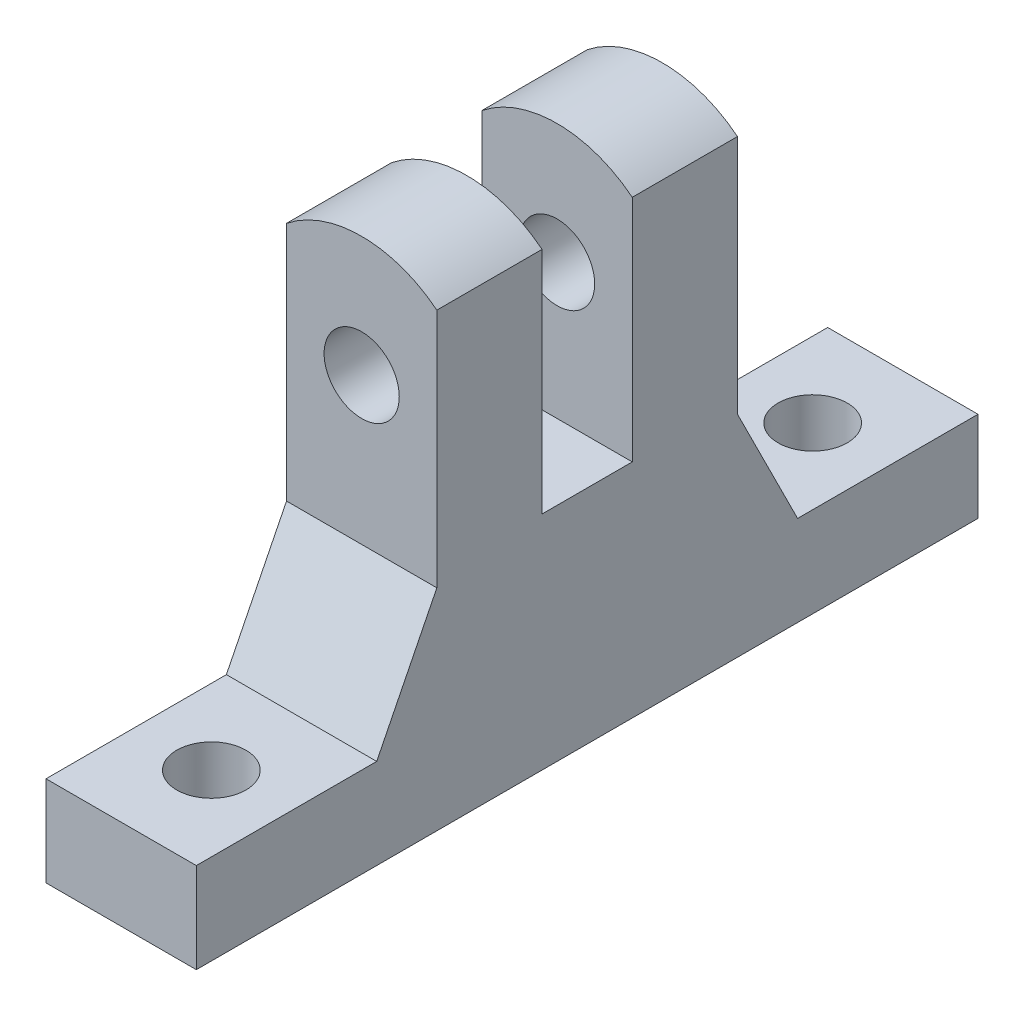
ISO-10303-21;
HEADER;
FILE_DESCRIPTION(('STEP AP214'),'2;1');
FILE_NAME('part.step','',(''),(''),'','','');
FILE_SCHEMA(('AUTOMOTIVE_DESIGN { 1 0 10303 214 1 1 1 1 }'));
ENDSEC;
DATA;
#1=APPLICATION_CONTEXT('core data for automotive mechanical design processes');
#2=APPLICATION_PROTOCOL_DEFINITION('international standard','automotive_design',2000,#1);
#3=PRODUCT_CONTEXT('',#1,'mechanical');
#4=PRODUCT('Part','Part','',(#3));
#5=PRODUCT_RELATED_PRODUCT_CATEGORY('part','',(#4));
#6=PRODUCT_DEFINITION_FORMATION('','',#4);
#7=PRODUCT_DEFINITION_CONTEXT('part definition',#1,'design');
#8=PRODUCT_DEFINITION('design','',#6,#7);
#9=PRODUCT_DEFINITION_SHAPE('','',#8);
#10=(LENGTH_UNIT() NAMED_UNIT(*) SI_UNIT(.MILLI.,.METRE.));
#11=(NAMED_UNIT(*) PLANE_ANGLE_UNIT() SI_UNIT($,.RADIAN.));
#12=(NAMED_UNIT(*) SI_UNIT($,.STERADIAN.) SOLID_ANGLE_UNIT());
#13=UNCERTAINTY_MEASURE_WITH_UNIT(LENGTH_MEASURE(1.E-05),#10,'distance_accuracy_value','');
#14=(GEOMETRIC_REPRESENTATION_CONTEXT(3) GLOBAL_UNCERTAINTY_ASSIGNED_CONTEXT((#13)) GLOBAL_UNIT_ASSIGNED_CONTEXT((#10,
#11,#12)) REPRESENTATION_CONTEXT('',''));
#15=CARTESIAN_POINT('',(0.,0.,0.));
#16=DIRECTION('',(0.,0.,1.));
#17=DIRECTION('',(1.,0.,0.));
#18=AXIS2_PLACEMENT_3D('',#15,#16,#17);
#19=CARTESIAN_POINT('',(0.,11.8775010008008,-10.));
#20=DIRECTION('',(0.,0.,1.));
#21=DIRECTION('',(1.,0.,0.));
#22=AXIS2_PLACEMENT_3D('',#19,#20,#21);
#23=CYLINDRICAL_SURFACE('',#22,4.);
#24=CARTESIAN_POINT('',(0.,11.8775010008008,-6.5));
#25=DIRECTION('',(0.,0.,-1.));
#26=DIRECTION('',(0.,1.,0.));
#27=AXIS2_PLACEMENT_3D('',#24,#25,#26);
#28=CIRCLE('',#27,4.);
#29=CARTESIAN_POINT('',(2.5,15.,-6.5));
#30=VERTEX_POINT('',#29);
#31=CARTESIAN_POINT('',(-2.5,15.,-6.5));
#32=VERTEX_POINT('',#31);
#33=EDGE_CURVE('E202',#30,#32,#28,.F.);
#34=ORIENTED_EDGE('',*,*,#33,.F.);
#35=DIRECTION('',(0.,0.,1.));
#36=VECTOR('',#35,1.);
#37=CARTESIAN_POINT('',(2.5,15.,-10.));
#38=LINE('',#37,#36);
#39=CARTESIAN_POINT('',(2.5,15.,-10.));
#40=VERTEX_POINT('',#39);
#41=EDGE_CURVE('E226',#40,#30,#38,.T.);
#42=ORIENTED_EDGE('',*,*,#41,.F.);
#43=CARTESIAN_POINT('',(0.,11.8775010008008,-10.));
#44=DIRECTION('',(0.,0.,1.));
#45=DIRECTION('',(1.,0.,0.));
#46=AXIS2_PLACEMENT_3D('',#43,#44,#45);
#47=CIRCLE('',#46,4.);
#48=CARTESIAN_POINT('',(-2.5,15.,-10.));
#49=VERTEX_POINT('',#48);
#50=EDGE_CURVE('E211',#40,#49,#47,.T.);
#51=ORIENTED_EDGE('',*,*,#50,.T.);
#52=DIRECTION('',(0.,0.,1.));
#53=VECTOR('',#52,1.);
#54=CARTESIAN_POINT('',(-2.5,15.,-10.));
#55=LINE('',#54,#53);
#56=EDGE_CURVE('E235',#49,#32,#55,.T.);
#57=ORIENTED_EDGE('',*,*,#56,.T.);
#58=EDGE_LOOP('',(#34,#42,#51,#57));
#59=FACE_BOUND('',#58,.T.);
#60=ADVANCED_FACE('F32',(#59),#23,.T.);
#61=CARTESIAN_POINT('',(0.,11.8775010008008,-10.));
#62=DIRECTION('',(0.,0.,1.));
#63=DIRECTION('',(1.,0.,0.));
#64=AXIS2_PLACEMENT_3D('',#61,#62,#63);
#65=CYLINDRICAL_SURFACE('',#64,1.25);
#66=CARTESIAN_POINT('',(0.,11.8775010008008,-6.5));
#67=DIRECTION('',(0.,0.,-1.));
#68=DIRECTION('',(0.,1.,0.));
#69=AXIS2_PLACEMENT_3D('',#66,#67,#68);
#70=CIRCLE('',#69,1.25);
#71=CARTESIAN_POINT('',(0.,13.1275010008008,-6.5));
#72=VERTEX_POINT('',#71);
#73=EDGE_CURVE('E201',#72,#72,#70,.F.);
#74=ORIENTED_EDGE('',*,*,#73,.T.);
#75=EDGE_LOOP('',(#74));
#76=FACE_BOUND('',#75,.T.);
#77=CARTESIAN_POINT('',(0.,11.8775010008008,-10.));
#78=DIRECTION('',(0.,0.,1.));
#79=DIRECTION('',(1.,0.,0.));
#80=AXIS2_PLACEMENT_3D('',#77,#78,#79);
#81=CIRCLE('',#80,1.25);
#82=CARTESIAN_POINT('',(1.25,11.8775010008008,-10.));
#83=VERTEX_POINT('',#82);
#84=EDGE_CURVE('E205',#83,#83,#81,.T.);
#85=ORIENTED_EDGE('',*,*,#84,.F.);
#86=EDGE_LOOP('',(#85));
#87=FACE_BOUND('',#86,.T.);
#88=ADVANCED_FACE('F307',(#76,#87),#65,.F.);
#89=CARTESIAN_POINT('',(0.,11.8775010008008,-3.5));
#90=DIRECTION('',(0.,0.,1.));
#91=DIRECTION('',(0.,-1.,0.));
#92=AXIS2_PLACEMENT_3D('',#89,#90,#91);
#93=CIRCLE('',#92,4.);
#94=CARTESIAN_POINT('',(-2.5,15.,-3.5));
#95=VERTEX_POINT('',#94);
#96=CARTESIAN_POINT('',(2.5,15.,-3.5));
#97=VERTEX_POINT('',#96);
#98=EDGE_CURVE('E199',#95,#97,#93,.F.);
#99=ORIENTED_EDGE('',*,*,#98,.F.);
#100=CARTESIAN_POINT('',(-2.5,15.,0.));
#101=VERTEX_POINT('',#100);
#102=EDGE_CURVE('E220',#95,#101,#55,.T.);
#103=ORIENTED_EDGE('',*,*,#102,.T.);
#104=CARTESIAN_POINT('',(0.,11.8775010008008,0.));
#105=DIRECTION('',(0.,0.,1.));
#106=DIRECTION('',(1.,0.,0.));
#107=AXIS2_PLACEMENT_3D('',#104,#105,#106);
#108=CIRCLE('',#107,4.);
#109=CARTESIAN_POINT('',(2.5,15.,0.));
#110=VERTEX_POINT('',#109);
#111=EDGE_CURVE('E208',#110,#101,#108,.T.);
#112=ORIENTED_EDGE('',*,*,#111,.F.);
#113=EDGE_CURVE('E230',#97,#110,#38,.T.);
#114=ORIENTED_EDGE('',*,*,#113,.F.);
#115=EDGE_LOOP('',(#99,#103,#112,#114));
#116=FACE_BOUND('',#115,.T.);
#117=ADVANCED_FACE('F297',(#116),#23,.T.);
#118=CARTESIAN_POINT('',(2.5,15.,-10.));
#119=DIRECTION('',(1.,0.,0.));
#120=DIRECTION('',(0.,1.,0.));
#121=AXIS2_PLACEMENT_3D('',#118,#119,#120);
#122=PLANE('',#121);
#123=DIRECTION('',(0.,1.,0.));
#124=VECTOR('',#123,1.);
#125=CARTESIAN_POINT('',(2.5,15.,0.));
#126=LINE('',#125,#124);
#127=CARTESIAN_POINT('',(2.5,6.99999999999997,0.));
#128=VERTEX_POINT('',#127);
#129=EDGE_CURVE('E215',#128,#110,#126,.T.);
#130=ORIENTED_EDGE('',*,*,#129,.F.);
#131=DIRECTION('',(0.,0.894427190999915,-0.44721359549996));
#132=VECTOR('',#131,1.);
#133=CARTESIAN_POINT('',(2.5,3.,2.));
#134=LINE('',#133,#132);
#135=CARTESIAN_POINT('',(2.5,3.,1.99999999999999));
#136=VERTEX_POINT('',#135);
#137=EDGE_CURVE('E11',#128,#136,#134,.F.);
#138=ORIENTED_EDGE('',*,*,#137,.T.);
#139=DIRECTION('',(0.,0.,1.));
#140=VECTOR('',#139,1.);
#141=CARTESIAN_POINT('',(2.5,3.,-18.));
#142=LINE('',#141,#140);
#143=CARTESIAN_POINT('',(2.5,3.,8.));
#144=VERTEX_POINT('',#143);
#145=EDGE_CURVE('E132',#136,#144,#142,.T.);
#146=ORIENTED_EDGE('',*,*,#145,.T.);
#147=DIRECTION('',(0.,-1.,0.));
#148=VECTOR('',#147,1.);
#149=CARTESIAN_POINT('',(2.5,3.,8.));
#150=LINE('',#149,#148);
#151=CARTESIAN_POINT('',(2.5,0.,8.));
#152=VERTEX_POINT('',#151);
#153=EDGE_CURVE('E135',#144,#152,#150,.T.);
#154=ORIENTED_EDGE('',*,*,#153,.T.);
#155=DIRECTION('',(0.,0.,1.));
#156=VECTOR('',#155,1.);
#157=CARTESIAN_POINT('',(2.5,0.,-10.));
#158=LINE('',#157,#156);
#159=CARTESIAN_POINT('',(2.5,0.,-18.));
#160=VERTEX_POINT('',#159);
#161=EDGE_CURVE('E231',#160,#152,#158,.T.);
#162=ORIENTED_EDGE('',*,*,#161,.F.);
#163=DIRECTION('',(0.,-1.,0.));
#164=VECTOR('',#163,1.);
#165=CARTESIAN_POINT('',(2.5,3.,-18.));
#166=LINE('',#165,#164);
#167=CARTESIAN_POINT('',(2.5,3.,-18.));
#168=VERTEX_POINT('',#167);
#169=EDGE_CURVE('E170',#168,#160,#166,.T.);
#170=ORIENTED_EDGE('',*,*,#169,.F.);
#171=CARTESIAN_POINT('',(2.5,3.,-12.));
#172=VERTEX_POINT('',#171);
#173=EDGE_CURVE('E142',#168,#172,#142,.T.);
#174=ORIENTED_EDGE('',*,*,#173,.T.);
#175=DIRECTION('',(0.,0.894427190999915,0.44721359549996));
#176=VECTOR('',#175,1.);
#177=CARTESIAN_POINT('',(2.5,6.99999999999997,-10.));
#178=LINE('',#177,#176);
#179=CARTESIAN_POINT('',(2.5,6.99999999999996,-10.));
#180=VERTEX_POINT('',#179);
#181=EDGE_CURVE('E248',#172,#180,#178,.T.);
#182=ORIENTED_EDGE('',*,*,#181,.T.);
#183=DIRECTION('',(0.,1.,0.));
#184=VECTOR('',#183,1.);
#185=CARTESIAN_POINT('',(2.5,15.,-10.));
#186=LINE('',#185,#184);
#187=EDGE_CURVE('E218',#180,#40,#186,.T.);
#188=ORIENTED_EDGE('',*,*,#187,.T.);
#189=ORIENTED_EDGE('',*,*,#41,.T.);
#190=DIRECTION('',(0.,-1.,0.));
#191=VECTOR('',#190,1.);
#192=CARTESIAN_POINT('',(2.5,15.8775010008008,-6.5));
#193=LINE('',#192,#191);
#194=CARTESIAN_POINT('',(2.5,7.3775010008008,-6.5));
#195=VERTEX_POINT('',#194);
#196=EDGE_CURVE('E178',#30,#195,#193,.T.);
#197=ORIENTED_EDGE('',*,*,#196,.T.);
#198=DIRECTION('',(0.,0.,1.));
#199=VECTOR('',#198,1.);
#200=CARTESIAN_POINT('',(2.5,7.3775010008008,-6.5));
#201=LINE('',#200,#199);
#202=CARTESIAN_POINT('',(2.5,7.3775010008008,-3.5));
#203=VERTEX_POINT('',#202);
#204=EDGE_CURVE('E181',#195,#203,#201,.T.);
#205=ORIENTED_EDGE('',*,*,#204,.T.);
#206=DIRECTION('',(0.,1.,0.));
#207=VECTOR('',#206,1.);
#208=CARTESIAN_POINT('',(2.5,15.8775010008008,-3.5));
#209=LINE('',#208,#207);
#210=EDGE_CURVE('E185',#203,#97,#209,.T.);
#211=ORIENTED_EDGE('',*,*,#210,.T.);
#212=ORIENTED_EDGE('',*,*,#113,.T.);
#213=EDGE_LOOP('',(#130,#138,#146,#154,#162,#170,#174,#182,#188,#189,#197,#205,#211,#212));
#214=FACE_BOUND('',#213,.T.);
#215=ADVANCED_FACE('F134',(#214),#122,.T.);
#216=CARTESIAN_POINT('',(-2.5,0.,-10.));
#217=DIRECTION('',(0.,-1.,0.));
#218=DIRECTION('',(0.,0.,-1.));
#219=AXIS2_PLACEMENT_3D('',#216,#217,#218);
#220=PLANE('',#219);
#221=ORIENTED_EDGE('',*,*,#161,.T.);
#222=DIRECTION('',(-1.,0.,0.));
#223=VECTOR('',#222,1.);
#224=CARTESIAN_POINT('',(-2.5,0.,8.));
#225=LINE('',#224,#223);
#226=CARTESIAN_POINT('',(-2.5,0.,8.));
#227=VERTEX_POINT('',#226);
#228=EDGE_CURVE('E151',#152,#227,#225,.T.);
#229=ORIENTED_EDGE('',*,*,#228,.T.);
#230=DIRECTION('',(0.,0.,1.));
#231=VECTOR('',#230,1.);
#232=CARTESIAN_POINT('',(-2.5,0.,-10.));
#233=LINE('',#232,#231);
#234=CARTESIAN_POINT('',(-2.5,0.,-18.));
#235=VERTEX_POINT('',#234);
#236=EDGE_CURVE('E233',#235,#227,#233,.T.);
#237=ORIENTED_EDGE('',*,*,#236,.F.);
#238=DIRECTION('',(1.,0.,0.));
#239=VECTOR('',#238,1.);
#240=CARTESIAN_POINT('',(-2.5,0.,-18.));
#241=LINE('',#240,#239);
#242=EDGE_CURVE('E143',#235,#160,#241,.T.);
#243=ORIENTED_EDGE('',*,*,#242,.T.);
#244=EDGE_LOOP('',(#221,#229,#237,#243));
#245=FACE_BOUND('',#244,.T.);
#246=CARTESIAN_POINT('',(0.,0.,5.));
#247=DIRECTION('',(0.,-1.,0.));
#248=DIRECTION('',(0.,0.,-1.));
#249=AXIS2_PLACEMENT_3D('',#246,#247,#248);
#250=CIRCLE('',#249,1.15);
#251=CARTESIAN_POINT('',(0.,0.,3.85));
#252=VERTEX_POINT('',#251);
#253=EDGE_CURVE('E368',#252,#252,#250,.T.);
#254=ORIENTED_EDGE('',*,*,#253,.F.);
#255=EDGE_LOOP('',(#254));
#256=FACE_BOUND('',#255,.T.);
#257=CARTESIAN_POINT('',(0.,0.,-15.));
#258=DIRECTION('',(0.,-1.,0.));
#259=DIRECTION('',(0.,0.,1.));
#260=AXIS2_PLACEMENT_3D('',#257,#258,#259);
#261=CIRCLE('',#260,1.15);
#262=CARTESIAN_POINT('',(0.,0.,-13.85));
#263=VERTEX_POINT('',#262);
#264=EDGE_CURVE('E365',#263,#263,#261,.T.);
#265=ORIENTED_EDGE('',*,*,#264,.F.);
#266=EDGE_LOOP('',(#265));
#267=FACE_BOUND('',#266,.T.);
#268=ADVANCED_FACE('F255',(#245,#256,#267),#220,.T.);
#269=CARTESIAN_POINT('',(-2.5,15.,-10.));
#270=DIRECTION('',(-1.,0.,0.));
#271=DIRECTION('',(0.,-1.,0.));
#272=AXIS2_PLACEMENT_3D('',#269,#270,#271);
#273=PLANE('',#272);
#274=DIRECTION('',(0.,-1.,0.));
#275=VECTOR('',#274,1.);
#276=CARTESIAN_POINT('',(-2.5,15.,-10.));
#277=LINE('',#276,#275);
#278=CARTESIAN_POINT('',(-2.5,6.99999999999996,-10.));
#279=VERTEX_POINT('',#278);
#280=EDGE_CURVE('E214',#49,#279,#277,.T.);
#281=ORIENTED_EDGE('',*,*,#280,.T.);
#282=DIRECTION('',(0.,-0.894427190999915,-0.44721359549996));
#283=VECTOR('',#282,1.);
#284=CARTESIAN_POINT('',(-2.5,6.99999999999997,-10.));
#285=LINE('',#284,#283);
#286=CARTESIAN_POINT('',(-2.5,3.,-12.));
#287=VERTEX_POINT('',#286);
#288=EDGE_CURVE('E246',#279,#287,#285,.T.);
#289=ORIENTED_EDGE('',*,*,#288,.T.);
#290=DIRECTION('',(0.,0.,-1.));
#291=VECTOR('',#290,1.);
#292=CARTESIAN_POINT('',(-2.5,3.,-18.));
#293=LINE('',#292,#291);
#294=CARTESIAN_POINT('',(-2.5,3.,-18.));
#295=VERTEX_POINT('',#294);
#296=EDGE_CURVE('E158',#287,#295,#293,.T.);
#297=ORIENTED_EDGE('',*,*,#296,.T.);
#298=DIRECTION('',(0.,-1.,0.));
#299=VECTOR('',#298,1.);
#300=CARTESIAN_POINT('',(-2.5,3.,-18.));
#301=LINE('',#300,#299);
#302=EDGE_CURVE('E174',#295,#235,#301,.T.);
#303=ORIENTED_EDGE('',*,*,#302,.T.);
#304=ORIENTED_EDGE('',*,*,#236,.T.);
#305=DIRECTION('',(0.,-1.,0.));
#306=VECTOR('',#305,1.);
#307=CARTESIAN_POINT('',(-2.5,3.,8.));
#308=LINE('',#307,#306);
#309=CARTESIAN_POINT('',(-2.5,3.,8.));
#310=VERTEX_POINT('',#309);
#311=EDGE_CURVE('E152',#310,#227,#308,.T.);
#312=ORIENTED_EDGE('',*,*,#311,.F.);
#313=CARTESIAN_POINT('',(-2.5,3.,1.99999999999999));
#314=VERTEX_POINT('',#313);
#315=EDGE_CURVE('E157',#310,#314,#293,.T.);
#316=ORIENTED_EDGE('',*,*,#315,.T.);
#317=DIRECTION('',(0.,-0.894427190999915,0.44721359549996));
#318=VECTOR('',#317,1.);
#319=CARTESIAN_POINT('',(-2.5,3.,2.));
#320=LINE('',#319,#318);
#321=CARTESIAN_POINT('',(-2.5,6.99999999999997,0.));
#322=VERTEX_POINT('',#321);
#323=EDGE_CURVE('E40',#314,#322,#320,.F.);
#324=ORIENTED_EDGE('',*,*,#323,.T.);
#325=DIRECTION('',(0.,-1.,0.));
#326=VECTOR('',#325,1.);
#327=CARTESIAN_POINT('',(-2.5,15.,0.));
#328=LINE('',#327,#326);
#329=EDGE_CURVE('E223',#101,#322,#328,.T.);
#330=ORIENTED_EDGE('',*,*,#329,.F.);
#331=ORIENTED_EDGE('',*,*,#102,.F.);
#332=DIRECTION('',(0.,1.,0.));
#333=VECTOR('',#332,1.);
#334=CARTESIAN_POINT('',(-2.5,15.8775010008008,-3.5));
#335=LINE('',#334,#333);
#336=CARTESIAN_POINT('',(-2.5,7.3775010008008,-3.5));
#337=VERTEX_POINT('',#336);
#338=EDGE_CURVE('E182',#337,#95,#335,.T.);
#339=ORIENTED_EDGE('',*,*,#338,.F.);
#340=DIRECTION('',(0.,0.,1.));
#341=VECTOR('',#340,1.);
#342=CARTESIAN_POINT('',(-2.5,7.3775010008008,-6.5));
#343=LINE('',#342,#341);
#344=CARTESIAN_POINT('',(-2.5,7.3775010008008,-6.5));
#345=VERTEX_POINT('',#344);
#346=EDGE_CURVE('E191',#345,#337,#343,.T.);
#347=ORIENTED_EDGE('',*,*,#346,.F.);
#348=DIRECTION('',(0.,-1.,0.));
#349=VECTOR('',#348,1.);
#350=CARTESIAN_POINT('',(-2.5,15.8775010008008,-6.5));
#351=LINE('',#350,#349);
#352=EDGE_CURVE('E173',#32,#345,#351,.T.);
#353=ORIENTED_EDGE('',*,*,#352,.F.);
#354=ORIENTED_EDGE('',*,*,#56,.F.);
#355=EDGE_LOOP('',(#281,#289,#297,#303,#304,#312,#316,#324,#330,#331,#339,#347,#353,#354));
#356=FACE_BOUND('',#355,.T.);
#357=ADVANCED_FACE('F253',(#356),#273,.T.);
#358=CARTESIAN_POINT('',(0.,11.8775010008008,-10.));
#359=DIRECTION('',(0.,0.,1.));
#360=DIRECTION('',(1.,0.,0.));
#361=AXIS2_PLACEMENT_3D('',#358,#359,#360);
#362=PLANE('',#361);
#363=ORIENTED_EDGE('',*,*,#84,.T.);
#364=EDGE_LOOP('',(#363));
#365=FACE_BOUND('',#364,.T.);
#366=ORIENTED_EDGE('',*,*,#187,.F.);
#367=DIRECTION('',(-1.,0.,0.));
#368=VECTOR('',#367,1.);
#369=CARTESIAN_POINT('',(0.,6.99999999999997,-10.));
#370=LINE('',#369,#368);
#371=EDGE_CURVE('E229',#180,#279,#370,.T.);
#372=ORIENTED_EDGE('',*,*,#371,.T.);
#373=ORIENTED_EDGE('',*,*,#280,.F.);
#374=ORIENTED_EDGE('',*,*,#50,.F.);
#375=EDGE_LOOP('',(#366,#372,#373,#374));
#376=FACE_BOUND('',#375,.T.);
#377=ADVANCED_FACE('F274',(#365,#376),#362,.F.);
#378=CARTESIAN_POINT('',(0.,11.8775010008008,0.));
#379=DIRECTION('',(0.,0.,1.));
#380=DIRECTION('',(1.,0.,0.));
#381=AXIS2_PLACEMENT_3D('',#378,#379,#380);
#382=PLANE('',#381);
#383=ORIENTED_EDGE('',*,*,#329,.T.);
#384=DIRECTION('',(1.,0.,0.));
#385=VECTOR('',#384,1.);
#386=CARTESIAN_POINT('',(2.5,6.99999999999997,0.));
#387=LINE('',#386,#385);
#388=EDGE_CURVE('E53',#322,#128,#387,.T.);
#389=ORIENTED_EDGE('',*,*,#388,.T.);
#390=ORIENTED_EDGE('',*,*,#129,.T.);
#391=ORIENTED_EDGE('',*,*,#111,.T.);
#392=EDGE_LOOP('',(#383,#389,#390,#391));
#393=FACE_BOUND('',#392,.T.);
#394=CARTESIAN_POINT('',(0.,11.8775010008008,0.));
#395=DIRECTION('',(0.,0.,1.));
#396=DIRECTION('',(1.,0.,0.));
#397=AXIS2_PLACEMENT_3D('',#394,#395,#396);
#398=CIRCLE('',#397,1.25);
#399=CARTESIAN_POINT('',(1.25,11.8775010008008,0.));
#400=VERTEX_POINT('',#399);
#401=EDGE_CURVE('E204',#400,#400,#398,.T.);
#402=ORIENTED_EDGE('',*,*,#401,.F.);
#403=EDGE_LOOP('',(#402));
#404=FACE_BOUND('',#403,.T.);
#405=ADVANCED_FACE('F299',(#393,#404),#382,.T.);
#406=CARTESIAN_POINT('',(0.,11.8775010008008,-3.5));
#407=DIRECTION('',(0.,0.,1.));
#408=DIRECTION('',(0.,-1.,0.));
#409=AXIS2_PLACEMENT_3D('',#406,#407,#408);
#410=CIRCLE('',#409,1.25);
#411=CARTESIAN_POINT('',(0.,10.6275010008008,-3.5));
#412=VERTEX_POINT('',#411);
#413=EDGE_CURVE('E197',#412,#412,#410,.F.);
#414=ORIENTED_EDGE('',*,*,#413,.T.);
#415=EDGE_LOOP('',(#414));
#416=FACE_BOUND('',#415,.T.);
#417=ORIENTED_EDGE('',*,*,#401,.T.);
#418=EDGE_LOOP('',(#417));
#419=FACE_BOUND('',#418,.T.);
#420=ADVANCED_FACE('F314',(#416,#419),#65,.F.);
#421=CARTESIAN_POINT('',(2.5,15.8775010008008,-6.5));
#422=DIRECTION('',(0.,0.,-1.));
#423=DIRECTION('',(0.,1.,0.));
#424=AXIS2_PLACEMENT_3D('',#421,#422,#423);
#425=PLANE('',#424);
#426=ORIENTED_EDGE('',*,*,#33,.T.);
#427=ORIENTED_EDGE('',*,*,#352,.T.);
#428=DIRECTION('',(-1.,0.,0.));
#429=VECTOR('',#428,1.);
#430=CARTESIAN_POINT('',(2.5,7.3775010008008,-6.5));
#431=LINE('',#430,#429);
#432=EDGE_CURVE('E188',#195,#345,#431,.T.);
#433=ORIENTED_EDGE('',*,*,#432,.F.);
#434=ORIENTED_EDGE('',*,*,#196,.F.);
#435=EDGE_LOOP('',(#426,#427,#433,#434));
#436=FACE_BOUND('',#435,.T.);
#437=ORIENTED_EDGE('',*,*,#73,.F.);
#438=EDGE_LOOP('',(#437));
#439=FACE_BOUND('',#438,.T.);
#440=ADVANCED_FACE('F283',(#436,#439),#425,.F.);
#441=CARTESIAN_POINT('',(2.5,15.8775010008008,-3.5));
#442=DIRECTION('',(0.,0.,1.));
#443=DIRECTION('',(0.,-1.,0.));
#444=AXIS2_PLACEMENT_3D('',#441,#442,#443);
#445=PLANE('',#444);
#446=ORIENTED_EDGE('',*,*,#98,.T.);
#447=ORIENTED_EDGE('',*,*,#210,.F.);
#448=DIRECTION('',(-1.,0.,0.));
#449=VECTOR('',#448,1.);
#450=CARTESIAN_POINT('',(2.5,7.3775010008008,-3.5));
#451=LINE('',#450,#449);
#452=EDGE_CURVE('E195',#203,#337,#451,.T.);
#453=ORIENTED_EDGE('',*,*,#452,.T.);
#454=ORIENTED_EDGE('',*,*,#338,.T.);
#455=EDGE_LOOP('',(#446,#447,#453,#454));
#456=FACE_BOUND('',#455,.T.);
#457=ORIENTED_EDGE('',*,*,#413,.F.);
#458=EDGE_LOOP('',(#457));
#459=FACE_BOUND('',#458,.T.);
#460=ADVANCED_FACE('F290',(#456,#459),#445,.F.);
#461=CARTESIAN_POINT('',(2.5,7.3775010008008,-6.5));
#462=DIRECTION('',(0.,-1.,0.));
#463=DIRECTION('',(1.,0.,0.));
#464=AXIS2_PLACEMENT_3D('',#461,#462,#463);
#465=PLANE('',#464);
#466=ORIENTED_EDGE('',*,*,#346,.T.);
#467=ORIENTED_EDGE('',*,*,#452,.F.);
#468=ORIENTED_EDGE('',*,*,#204,.F.);
#469=ORIENTED_EDGE('',*,*,#432,.T.);
#470=EDGE_LOOP('',(#466,#467,#468,#469));
#471=FACE_BOUND('',#470,.T.);
#472=ADVANCED_FACE('F286',(#471),#465,.F.);
#473=CARTESIAN_POINT('',(0.,3.,5.));
#474=DIRECTION('',(0.,-1.,0.));
#475=DIRECTION('',(0.,0.,-1.));
#476=AXIS2_PLACEMENT_3D('',#473,#474,#475);
#477=CYLINDRICAL_SURFACE('',#476,1.15);
#478=CARTESIAN_POINT('',(0.,3.,5.));
#479=DIRECTION('',(0.,-1.,0.));
#480=DIRECTION('',(0.,0.,-1.));
#481=AXIS2_PLACEMENT_3D('',#478,#479,#480);
#482=CIRCLE('',#481,1.15);
#483=CARTESIAN_POINT('',(0.,3.,3.85));
#484=VERTEX_POINT('',#483);
#485=EDGE_CURVE('E167',#484,#484,#482,.T.);
#486=ORIENTED_EDGE('',*,*,#485,.F.);
#487=EDGE_LOOP('',(#486));
#488=FACE_BOUND('',#487,.T.);
#489=ORIENTED_EDGE('',*,*,#253,.T.);
#490=EDGE_LOOP('',(#489));
#491=FACE_BOUND('',#490,.T.);
#492=ADVANCED_FACE('F342',(#488,#491),#477,.F.);
#493=CARTESIAN_POINT('',(-2.5,3.,8.));
#494=DIRECTION('',(0.,0.,1.));
#495=DIRECTION('',(1.,0.,0.));
#496=AXIS2_PLACEMENT_3D('',#493,#494,#495);
#497=PLANE('',#496);
#498=ORIENTED_EDGE('',*,*,#228,.F.);
#499=ORIENTED_EDGE('',*,*,#153,.F.);
#500=DIRECTION('',(-1.,0.,0.));
#501=VECTOR('',#500,1.);
#502=CARTESIAN_POINT('',(-2.5,3.,8.));
#503=LINE('',#502,#501);
#504=EDGE_CURVE('E149',#144,#310,#503,.T.);
#505=ORIENTED_EDGE('',*,*,#504,.T.);
#506=ORIENTED_EDGE('',*,*,#311,.T.);
#507=EDGE_LOOP('',(#498,#499,#505,#506));
#508=FACE_BOUND('',#507,.T.);
#509=ADVANCED_FACE('F147',(#508),#497,.T.);
#510=CARTESIAN_POINT('',(0.,3.,0.));
#511=DIRECTION('',(0.,1.,0.));
#512=DIRECTION('',(0.,0.,1.));
#513=AXIS2_PLACEMENT_3D('',#510,#511,#512);
#514=PLANE('',#513);
#515=ORIENTED_EDGE('',*,*,#485,.T.);
#516=EDGE_LOOP('',(#515));
#517=FACE_BOUND('',#516,.T.);
#518=ORIENTED_EDGE('',*,*,#145,.F.);
#519=DIRECTION('',(-1.,0.,0.));
#520=VECTOR('',#519,1.);
#521=CARTESIAN_POINT('',(-2.5,3.,2.));
#522=LINE('',#521,#520);
#523=EDGE_CURVE('E250',#136,#314,#522,.T.);
#524=ORIENTED_EDGE('',*,*,#523,.T.);
#525=ORIENTED_EDGE('',*,*,#315,.F.);
#526=ORIENTED_EDGE('',*,*,#504,.F.);
#527=EDGE_LOOP('',(#518,#524,#525,#526));
#528=FACE_BOUND('',#527,.T.);
#529=ADVANCED_FACE('F156',(#517,#528),#514,.T.);
#530=CARTESIAN_POINT('',(0.,3.,-15.));
#531=DIRECTION('',(0.,-1.,0.));
#532=DIRECTION('',(0.,0.,1.));
#533=AXIS2_PLACEMENT_3D('',#530,#531,#532);
#534=CIRCLE('',#533,1.15);
#535=CARTESIAN_POINT('',(0.,3.,-13.85));
#536=VERTEX_POINT('',#535);
#537=EDGE_CURVE('E362',#536,#536,#534,.T.);
#538=ORIENTED_EDGE('',*,*,#537,.T.);
#539=EDGE_LOOP('',(#538));
#540=FACE_BOUND('',#539,.T.);
#541=ORIENTED_EDGE('',*,*,#296,.F.);
#542=DIRECTION('',(1.,0.,0.));
#543=VECTOR('',#542,1.);
#544=CARTESIAN_POINT('',(0.,3.,-12.));
#545=LINE('',#544,#543);
#546=EDGE_CURVE('E244',#287,#172,#545,.T.);
#547=ORIENTED_EDGE('',*,*,#546,.T.);
#548=ORIENTED_EDGE('',*,*,#173,.F.);
#549=DIRECTION('',(1.,0.,0.));
#550=VECTOR('',#549,1.);
#551=CARTESIAN_POINT('',(-2.5,3.,-18.));
#552=LINE('',#551,#550);
#553=EDGE_CURVE('E153',#295,#168,#552,.T.);
#554=ORIENTED_EDGE('',*,*,#553,.F.);
#555=EDGE_LOOP('',(#541,#547,#548,#554));
#556=FACE_BOUND('',#555,.T.);
#557=ADVANCED_FACE('F265',(#540,#556),#514,.T.);
#558=CARTESIAN_POINT('',(-2.5,3.,-18.));
#559=DIRECTION('',(0.,0.,-1.));
#560=DIRECTION('',(-1.,0.,0.));
#561=AXIS2_PLACEMENT_3D('',#558,#559,#560);
#562=PLANE('',#561);
#563=ORIENTED_EDGE('',*,*,#242,.F.);
#564=ORIENTED_EDGE('',*,*,#302,.F.);
#565=ORIENTED_EDGE('',*,*,#553,.T.);
#566=ORIENTED_EDGE('',*,*,#169,.T.);
#567=EDGE_LOOP('',(#563,#564,#565,#566));
#568=FACE_BOUND('',#567,.T.);
#569=ADVANCED_FACE('F260',(#568),#562,.T.);
#570=CARTESIAN_POINT('',(0.,3.,-15.));
#571=DIRECTION('',(0.,-1.,0.));
#572=DIRECTION('',(0.,0.,-1.));
#573=AXIS2_PLACEMENT_3D('',#570,#571,#572);
#574=CYLINDRICAL_SURFACE('',#573,1.15);
#575=ORIENTED_EDGE('',*,*,#537,.F.);
#576=EDGE_LOOP('',(#575));
#577=FACE_BOUND('',#576,.T.);
#578=ORIENTED_EDGE('',*,*,#264,.T.);
#579=EDGE_LOOP('',(#578));
#580=FACE_BOUND('',#579,.T.);
#581=ADVANCED_FACE('F305',(#577,#580),#574,.F.);
#582=CARTESIAN_POINT('',(0.,6.99999999999997,-10.));
#583=DIRECTION('',(0.,-0.44721359549996,0.894427190999915));
#584=DIRECTION('',(-1.,0.,0.));
#585=AXIS2_PLACEMENT_3D('',#582,#583,#584);
#586=PLANE('',#585);
#587=ORIENTED_EDGE('',*,*,#181,.F.);
#588=ORIENTED_EDGE('',*,*,#546,.F.);
#589=ORIENTED_EDGE('',*,*,#288,.F.);
#590=ORIENTED_EDGE('',*,*,#371,.F.);
#591=EDGE_LOOP('',(#587,#588,#589,#590));
#592=FACE_BOUND('',#591,.T.);
#593=ADVANCED_FACE('F271',(#592),#586,.F.);
#594=CARTESIAN_POINT('',(0.,3.,2.));
#595=DIRECTION('',(0.,0.44721359549996,0.894427190999915));
#596=DIRECTION('',(1.,0.,0.));
#597=AXIS2_PLACEMENT_3D('',#594,#595,#596);
#598=PLANE('',#597);
#599=ORIENTED_EDGE('',*,*,#137,.F.);
#600=ORIENTED_EDGE('',*,*,#388,.F.);
#601=ORIENTED_EDGE('',*,*,#323,.F.);
#602=ORIENTED_EDGE('',*,*,#523,.F.);
#603=EDGE_LOOP('',(#599,#600,#601,#602));
#604=FACE_BOUND('',#603,.T.);
#605=ADVANCED_FACE('F34',(#604),#598,.T.);
#606=CLOSED_SHELL('',(#60,#88,#117,#215,#268,#357,#377,#405,#420,#440,#460,#472,#492,#509,#529,
#557,#569,#581,#593,#605));
#607=MANIFOLD_SOLID_BREP('B2',#606);
#608=ADVANCED_BREP_SHAPE_REPRESENTATION('',(#18,#607),#14);
#609=SHAPE_DEFINITION_REPRESENTATION(#9,#608);
ENDSEC;
END-ISO-10303-21;
